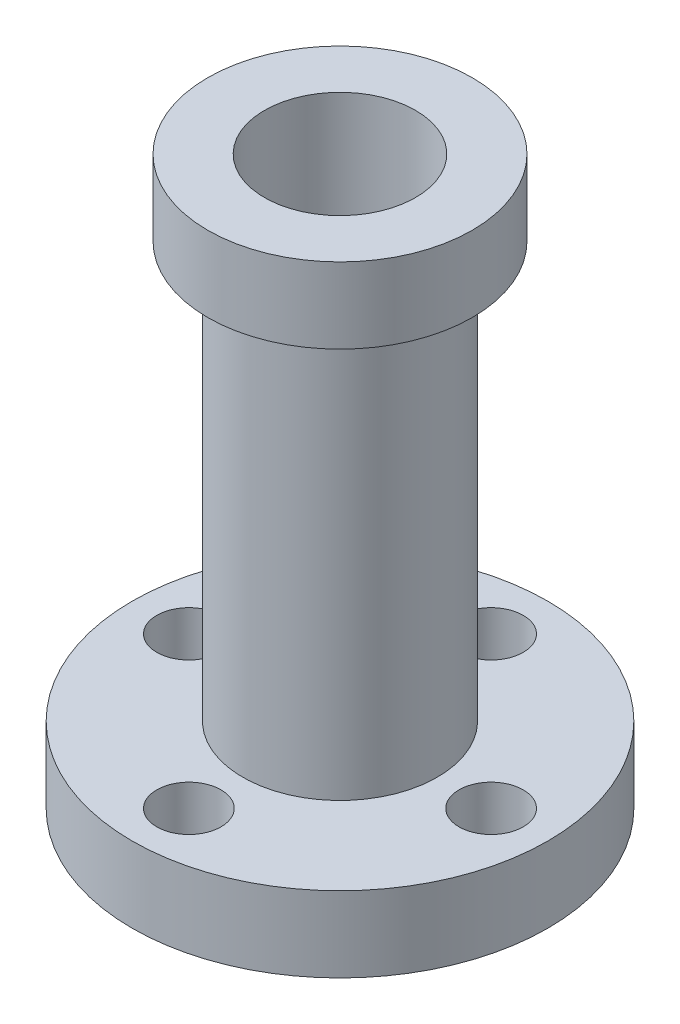
ISO-10303-21;
HEADER;
FILE_DESCRIPTION(('STEP AP214'),'2;1');
FILE_NAME('part.step','',(''),(''),'','','');
FILE_SCHEMA(('AUTOMOTIVE_DESIGN { 1 0 10303 214 1 1 1 1 }'));
ENDSEC;
DATA;
#1=APPLICATION_CONTEXT('core data for automotive mechanical design processes');
#2=APPLICATION_PROTOCOL_DEFINITION('international standard','automotive_design',2000,#1);
#3=PRODUCT_CONTEXT('',#1,'mechanical');
#4=PRODUCT('Part','Part','',(#3));
#5=PRODUCT_RELATED_PRODUCT_CATEGORY('part','',(#4));
#6=PRODUCT_DEFINITION_FORMATION('','',#4);
#7=PRODUCT_DEFINITION_CONTEXT('part definition',#1,'design');
#8=PRODUCT_DEFINITION('design','',#6,#7);
#9=PRODUCT_DEFINITION_SHAPE('','',#8);
#10=(LENGTH_UNIT() NAMED_UNIT(*) SI_UNIT(.MILLI.,.METRE.));
#11=(NAMED_UNIT(*) PLANE_ANGLE_UNIT() SI_UNIT($,.RADIAN.));
#12=(NAMED_UNIT(*) SI_UNIT($,.STERADIAN.) SOLID_ANGLE_UNIT());
#13=UNCERTAINTY_MEASURE_WITH_UNIT(LENGTH_MEASURE(1.E-05),#10,'distance_accuracy_value','');
#14=(GEOMETRIC_REPRESENTATION_CONTEXT(3) GLOBAL_UNCERTAINTY_ASSIGNED_CONTEXT((#13)) GLOBAL_UNIT_ASSIGNED_CONTEXT((#10,
#11,#12)) REPRESENTATION_CONTEXT('',''));
#15=CARTESIAN_POINT('',(0.,0.,0.));
#16=DIRECTION('',(0.,0.,1.));
#17=DIRECTION('',(1.,0.,0.));
#18=AXIS2_PLACEMENT_3D('',#15,#16,#17);
#19=CARTESIAN_POINT('',(11.,4.,0.));
#20=DIRECTION('',(0.,1.,0.));
#21=DIRECTION('',(0.,0.,1.));
#22=AXIS2_PLACEMENT_3D('',#19,#20,#21);
#23=PLANE('',#22);
#24=CARTESIAN_POINT('',(0.,4.,8.));
#25=DIRECTION('',(0.,1.,0.));
#26=DIRECTION('',(0.,0.,1.));
#27=AXIS2_PLACEMENT_3D('',#24,#25,#26);
#28=CIRCLE('',#27,1.69999999999999);
#29=CARTESIAN_POINT('',(0.,4.,9.7));
#30=VERTEX_POINT('',#29);
#31=EDGE_CURVE('E80',#30,#30,#28,.F.);
#32=ORIENTED_EDGE('',*,*,#31,.T.);
#33=EDGE_LOOP('',(#32));
#34=FACE_BOUND('',#33,.T.);
#35=CARTESIAN_POINT('',(-8.,4.,0.));
#36=DIRECTION('',(0.,1.,0.));
#37=DIRECTION('',(0.,0.,1.));
#38=AXIS2_PLACEMENT_3D('',#35,#36,#37);
#39=CIRCLE('',#38,1.69999999999999);
#40=CARTESIAN_POINT('',(-8.,4.,1.69999999999999));
#41=VERTEX_POINT('',#40);
#42=EDGE_CURVE('E62',#41,#41,#39,.F.);
#43=ORIENTED_EDGE('',*,*,#42,.T.);
#44=EDGE_LOOP('',(#43));
#45=FACE_BOUND('',#44,.T.);
#46=CARTESIAN_POINT('',(0.,4.,0.));
#47=DIRECTION('',(0.,-1.,0.));
#48=DIRECTION('',(0.,0.,-1.));
#49=AXIS2_PLACEMENT_3D('',#46,#47,#48);
#50=CIRCLE('',#49,5.15);
#51=CARTESIAN_POINT('',(0.,4.,-5.15));
#52=VERTEX_POINT('',#51);
#53=EDGE_CURVE('E50',#52,#52,#50,.T.);
#54=ORIENTED_EDGE('',*,*,#53,.T.);
#55=EDGE_LOOP('',(#54));
#56=FACE_BOUND('',#55,.T.);
#57=CARTESIAN_POINT('',(0.,4.,0.));
#58=DIRECTION('',(0.,-1.,0.));
#59=DIRECTION('',(0.,0.,-1.));
#60=AXIS2_PLACEMENT_3D('',#57,#58,#59);
#61=CIRCLE('',#60,11.);
#62=CARTESIAN_POINT('',(0.,4.,-11.));
#63=VERTEX_POINT('',#62);
#64=EDGE_CURVE('E45',#63,#63,#61,.T.);
#65=ORIENTED_EDGE('',*,*,#64,.F.);
#66=EDGE_LOOP('',(#65));
#67=FACE_BOUND('',#66,.T.);
#68=CARTESIAN_POINT('',(0.,4.,-8.));
#69=DIRECTION('',(0.,1.,0.));
#70=DIRECTION('',(0.,0.,1.));
#71=AXIS2_PLACEMENT_3D('',#68,#69,#70);
#72=CIRCLE('',#71,1.69999999999999);
#73=CARTESIAN_POINT('',(0.,4.,-6.30000000000001));
#74=VERTEX_POINT('',#73);
#75=EDGE_CURVE('E68',#74,#74,#72,.F.);
#76=ORIENTED_EDGE('',*,*,#75,.T.);
#77=EDGE_LOOP('',(#76));
#78=FACE_BOUND('',#77,.T.);
#79=CARTESIAN_POINT('',(8.,4.,0.));
#80=DIRECTION('',(0.,1.,0.));
#81=DIRECTION('',(0.,0.,1.));
#82=AXIS2_PLACEMENT_3D('',#79,#80,#81);
#83=CIRCLE('',#82,1.69999999999999);
#84=CARTESIAN_POINT('',(8.,4.,1.7));
#85=VERTEX_POINT('',#84);
#86=EDGE_CURVE('E74',#85,#85,#83,.F.);
#87=ORIENTED_EDGE('',*,*,#86,.T.);
#88=EDGE_LOOP('',(#87));
#89=FACE_BOUND('',#88,.T.);
#90=ADVANCED_FACE('F30',(#34,#45,#56,#67,#78,#89),#23,.T.);
#91=CARTESIAN_POINT('',(7.,30.,0.));
#92=DIRECTION('',(0.,1.,0.));
#93=DIRECTION('',(0.,0.,1.));
#94=AXIS2_PLACEMENT_3D('',#91,#92,#93);
#95=PLANE('',#94);
#96=CARTESIAN_POINT('',(0.,30.,0.));
#97=DIRECTION('',(0.,-1.,0.));
#98=DIRECTION('',(0.,0.,-1.));
#99=AXIS2_PLACEMENT_3D('',#96,#97,#98);
#100=CIRCLE('',#99,4.);
#101=CARTESIAN_POINT('',(0.,30.,-4.));
#102=VERTEX_POINT('',#101);
#103=EDGE_CURVE('E10',#102,#102,#100,.T.);
#104=ORIENTED_EDGE('',*,*,#103,.T.);
#105=EDGE_LOOP('',(#104));
#106=FACE_BOUND('',#105,.T.);
#107=CARTESIAN_POINT('',(0.,30.,0.));
#108=DIRECTION('',(0.,-1.,0.));
#109=DIRECTION('',(0.,0.,-1.));
#110=AXIS2_PLACEMENT_3D('',#107,#108,#109);
#111=CIRCLE('',#110,7.);
#112=CARTESIAN_POINT('',(0.,30.,-7.));
#113=VERTEX_POINT('',#112);
#114=EDGE_CURVE('E59',#113,#113,#111,.T.);
#115=ORIENTED_EDGE('',*,*,#114,.F.);
#116=EDGE_LOOP('',(#115));
#117=FACE_BOUND('',#116,.T.);
#118=ADVANCED_FACE('F32',(#106,#117),#95,.T.);
#119=CARTESIAN_POINT('',(0.,0.,0.));
#120=DIRECTION('',(0.,-1.,0.));
#121=DIRECTION('',(0.,0.,-1.));
#122=AXIS2_PLACEMENT_3D('',#119,#120,#121);
#123=CYLINDRICAL_SURFACE('',#122,4.);
#124=CARTESIAN_POINT('',(0.,0.,0.));
#125=DIRECTION('',(0.,-1.,0.));
#126=DIRECTION('',(0.,0.,-1.));
#127=AXIS2_PLACEMENT_3D('',#124,#125,#126);
#128=CIRCLE('',#127,4.);
#129=CARTESIAN_POINT('',(0.,0.,-4.));
#130=VERTEX_POINT('',#129);
#131=EDGE_CURVE('E37',#130,#130,#128,.T.);
#132=ORIENTED_EDGE('',*,*,#131,.T.);
#133=EDGE_LOOP('',(#132));
#134=FACE_BOUND('',#133,.T.);
#135=ORIENTED_EDGE('',*,*,#103,.F.);
#136=EDGE_LOOP('',(#135));
#137=FACE_BOUND('',#136,.T.);
#138=ADVANCED_FACE('F93',(#134,#137),#123,.F.);
#139=CARTESIAN_POINT('',(4.,0.,0.));
#140=DIRECTION('',(0.,-1.,0.));
#141=DIRECTION('',(0.,0.,-1.));
#142=AXIS2_PLACEMENT_3D('',#139,#140,#141);
#143=PLANE('',#142);
#144=CARTESIAN_POINT('',(0.,0.,8.));
#145=DIRECTION('',(0.,-1.,0.));
#146=DIRECTION('',(0.,0.,-1.));
#147=AXIS2_PLACEMENT_3D('',#144,#145,#146);
#148=CIRCLE('',#147,1.69999999999999);
#149=CARTESIAN_POINT('',(0.,0.,6.30000000000001));
#150=VERTEX_POINT('',#149);
#151=EDGE_CURVE('E83',#150,#150,#148,.T.);
#152=ORIENTED_EDGE('',*,*,#151,.F.);
#153=EDGE_LOOP('',(#152));
#154=FACE_BOUND('',#153,.T.);
#155=CARTESIAN_POINT('',(8.,0.,0.));
#156=DIRECTION('',(0.,-1.,0.));
#157=DIRECTION('',(0.,0.,-1.));
#158=AXIS2_PLACEMENT_3D('',#155,#156,#157);
#159=CIRCLE('',#158,1.69999999999999);
#160=CARTESIAN_POINT('',(8.,0.,-1.69999999999999));
#161=VERTEX_POINT('',#160);
#162=EDGE_CURVE('E77',#161,#161,#159,.T.);
#163=ORIENTED_EDGE('',*,*,#162,.F.);
#164=EDGE_LOOP('',(#163));
#165=FACE_BOUND('',#164,.T.);
#166=CARTESIAN_POINT('',(0.,0.,-8.));
#167=DIRECTION('',(0.,-1.,0.));
#168=DIRECTION('',(0.,0.,-1.));
#169=AXIS2_PLACEMENT_3D('',#166,#167,#168);
#170=CIRCLE('',#169,1.69999999999999);
#171=CARTESIAN_POINT('',(0.,0.,-9.69999999999999));
#172=VERTEX_POINT('',#171);
#173=EDGE_CURVE('E71',#172,#172,#170,.T.);
#174=ORIENTED_EDGE('',*,*,#173,.F.);
#175=EDGE_LOOP('',(#174));
#176=FACE_BOUND('',#175,.T.);
#177=CARTESIAN_POINT('',(-8.,0.,0.));
#178=DIRECTION('',(0.,-1.,0.));
#179=DIRECTION('',(0.,0.,-1.));
#180=AXIS2_PLACEMENT_3D('',#177,#178,#179);
#181=CIRCLE('',#180,1.69999999999999);
#182=CARTESIAN_POINT('',(-8.,0.,-1.69999999999999));
#183=VERTEX_POINT('',#182);
#184=EDGE_CURVE('E65',#183,#183,#181,.T.);
#185=ORIENTED_EDGE('',*,*,#184,.F.);
#186=EDGE_LOOP('',(#185));
#187=FACE_BOUND('',#186,.T.);
#188=CARTESIAN_POINT('',(0.,0.,0.));
#189=DIRECTION('',(0.,-1.,0.));
#190=DIRECTION('',(0.,0.,-1.));
#191=AXIS2_PLACEMENT_3D('',#188,#189,#190);
#192=CIRCLE('',#191,11.);
#193=CARTESIAN_POINT('',(0.,0.,-11.));
#194=VERTEX_POINT('',#193);
#195=EDGE_CURVE('E41',#194,#194,#192,.T.);
#196=ORIENTED_EDGE('',*,*,#195,.T.);
#197=EDGE_LOOP('',(#196));
#198=FACE_BOUND('',#197,.T.);
#199=ORIENTED_EDGE('',*,*,#131,.F.);
#200=EDGE_LOOP('',(#199));
#201=FACE_BOUND('',#200,.T.);
#202=ADVANCED_FACE('F89',(#154,#165,#176,#187,#198,#201),#143,.T.);
#203=CARTESIAN_POINT('',(0.,0.,0.));
#204=DIRECTION('',(0.,-1.,0.));
#205=DIRECTION('',(0.,0.,-1.));
#206=AXIS2_PLACEMENT_3D('',#203,#204,#205);
#207=CYLINDRICAL_SURFACE('',#206,11.);
#208=ORIENTED_EDGE('',*,*,#64,.T.);
#209=EDGE_LOOP('',(#208));
#210=FACE_BOUND('',#209,.T.);
#211=ORIENTED_EDGE('',*,*,#195,.F.);
#212=EDGE_LOOP('',(#211));
#213=FACE_BOUND('',#212,.T.);
#214=ADVANCED_FACE('F92',(#210,#213),#207,.T.);
#215=CARTESIAN_POINT('',(0.,0.,0.));
#216=DIRECTION('',(0.,-1.,0.));
#217=DIRECTION('',(0.,0.,-1.));
#218=AXIS2_PLACEMENT_3D('',#215,#216,#217);
#219=CYLINDRICAL_SURFACE('',#218,5.15);
#220=CARTESIAN_POINT('',(0.,26.,0.));
#221=DIRECTION('',(0.,-1.,0.));
#222=DIRECTION('',(0.,0.,-1.));
#223=AXIS2_PLACEMENT_3D('',#220,#221,#222);
#224=CIRCLE('',#223,5.15);
#225=CARTESIAN_POINT('',(0.,26.,-5.15));
#226=VERTEX_POINT('',#225);
#227=EDGE_CURVE('E53',#226,#226,#224,.T.);
#228=ORIENTED_EDGE('',*,*,#227,.T.);
#229=EDGE_LOOP('',(#228));
#230=FACE_BOUND('',#229,.T.);
#231=ORIENTED_EDGE('',*,*,#53,.F.);
#232=EDGE_LOOP('',(#231));
#233=FACE_BOUND('',#232,.T.);
#234=ADVANCED_FACE('F105',(#230,#233),#219,.T.);
#235=CARTESIAN_POINT('',(5.15,26.,0.));
#236=DIRECTION('',(0.,-1.,0.));
#237=DIRECTION('',(0.,0.,-1.));
#238=AXIS2_PLACEMENT_3D('',#235,#236,#237);
#239=PLANE('',#238);
#240=CARTESIAN_POINT('',(0.,26.,0.));
#241=DIRECTION('',(0.,-1.,0.));
#242=DIRECTION('',(0.,0.,-1.));
#243=AXIS2_PLACEMENT_3D('',#240,#241,#242);
#244=CIRCLE('',#243,7.);
#245=CARTESIAN_POINT('',(0.,26.,-7.));
#246=VERTEX_POINT('',#245);
#247=EDGE_CURVE('E56',#246,#246,#244,.T.);
#248=ORIENTED_EDGE('',*,*,#247,.T.);
#249=EDGE_LOOP('',(#248));
#250=FACE_BOUND('',#249,.T.);
#251=ORIENTED_EDGE('',*,*,#227,.F.);
#252=EDGE_LOOP('',(#251));
#253=FACE_BOUND('',#252,.T.);
#254=ADVANCED_FACE('F111',(#250,#253),#239,.T.);
#255=CARTESIAN_POINT('',(0.,0.,0.));
#256=DIRECTION('',(0.,-1.,0.));
#257=DIRECTION('',(0.,0.,-1.));
#258=AXIS2_PLACEMENT_3D('',#255,#256,#257);
#259=CYLINDRICAL_SURFACE('',#258,7.);
#260=ORIENTED_EDGE('',*,*,#114,.T.);
#261=EDGE_LOOP('',(#260));
#262=FACE_BOUND('',#261,.T.);
#263=ORIENTED_EDGE('',*,*,#247,.F.);
#264=EDGE_LOOP('',(#263));
#265=FACE_BOUND('',#264,.T.);
#266=ADVANCED_FACE('F124',(#262,#265),#259,.T.);
#267=CARTESIAN_POINT('',(-8.,0.,0.));
#268=DIRECTION('',(0.,-1.,0.));
#269=DIRECTION('',(0.,0.,-1.));
#270=AXIS2_PLACEMENT_3D('',#267,#268,#269);
#271=CYLINDRICAL_SURFACE('',#270,1.69999999999999);
#272=ORIENTED_EDGE('',*,*,#42,.F.);
#273=EDGE_LOOP('',(#272));
#274=FACE_BOUND('',#273,.T.);
#275=ORIENTED_EDGE('',*,*,#184,.T.);
#276=EDGE_LOOP('',(#275));
#277=FACE_BOUND('',#276,.T.);
#278=ADVANCED_FACE('F128',(#274,#277),#271,.F.);
#279=CARTESIAN_POINT('',(0.,0.,-8.));
#280=DIRECTION('',(0.,-1.,0.));
#281=DIRECTION('',(0.,0.,-1.));
#282=AXIS2_PLACEMENT_3D('',#279,#280,#281);
#283=CYLINDRICAL_SURFACE('',#282,1.69999999999999);
#284=ORIENTED_EDGE('',*,*,#75,.F.);
#285=EDGE_LOOP('',(#284));
#286=FACE_BOUND('',#285,.T.);
#287=ORIENTED_EDGE('',*,*,#173,.T.);
#288=EDGE_LOOP('',(#287));
#289=FACE_BOUND('',#288,.T.);
#290=ADVANCED_FACE('F132',(#286,#289),#283,.F.);
#291=CARTESIAN_POINT('',(8.,0.,0.));
#292=DIRECTION('',(0.,-1.,0.));
#293=DIRECTION('',(0.,0.,-1.));
#294=AXIS2_PLACEMENT_3D('',#291,#292,#293);
#295=CYLINDRICAL_SURFACE('',#294,1.69999999999999);
#296=ORIENTED_EDGE('',*,*,#86,.F.);
#297=EDGE_LOOP('',(#296));
#298=FACE_BOUND('',#297,.T.);
#299=ORIENTED_EDGE('',*,*,#162,.T.);
#300=EDGE_LOOP('',(#299));
#301=FACE_BOUND('',#300,.T.);
#302=ADVANCED_FACE('F136',(#298,#301),#295,.F.);
#303=CARTESIAN_POINT('',(0.,0.,8.));
#304=DIRECTION('',(0.,-1.,0.));
#305=DIRECTION('',(0.,0.,-1.));
#306=AXIS2_PLACEMENT_3D('',#303,#304,#305);
#307=CYLINDRICAL_SURFACE('',#306,1.69999999999999);
#308=ORIENTED_EDGE('',*,*,#31,.F.);
#309=EDGE_LOOP('',(#308));
#310=FACE_BOUND('',#309,.T.);
#311=ORIENTED_EDGE('',*,*,#151,.T.);
#312=EDGE_LOOP('',(#311));
#313=FACE_BOUND('',#312,.T.);
#314=ADVANCED_FACE('F87',(#310,#313),#307,.F.);
#315=CLOSED_SHELL('',(#90,#118,#138,#202,#214,#234,#254,#266,#278,#290,#302,#314));
#316=MANIFOLD_SOLID_BREP('B2',#315);
#317=ADVANCED_BREP_SHAPE_REPRESENTATION('',(#18,#316),#14);
#318=SHAPE_DEFINITION_REPRESENTATION(#9,#317);
ENDSEC;
END-ISO-10303-21;
